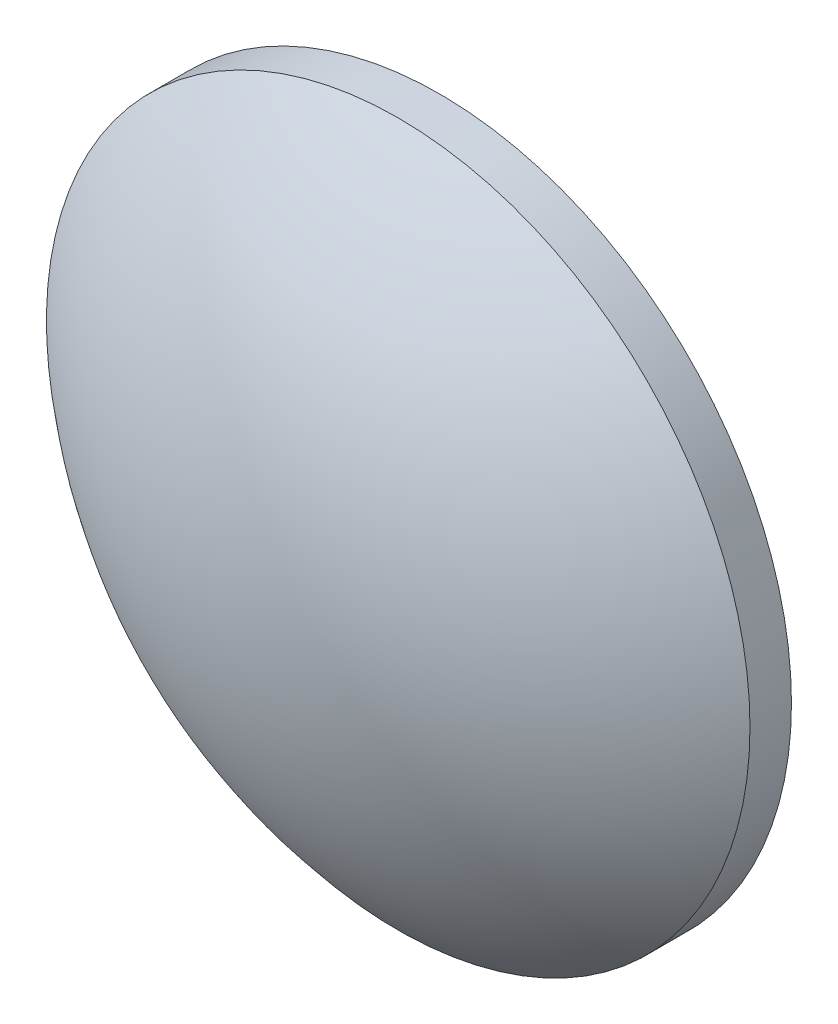
ISO-10303-21;
HEADER;
FILE_DESCRIPTION(('STEP AP214'),'2;1');
FILE_NAME('part.step','',(''),(''),'','','');
FILE_SCHEMA(('AUTOMOTIVE_DESIGN { 1 0 10303 214 1 1 1 1 }'));
ENDSEC;
DATA;
#1=APPLICATION_CONTEXT('core data for automotive mechanical design processes');
#2=APPLICATION_PROTOCOL_DEFINITION('international standard','automotive_design',2000,#1);
#3=PRODUCT_CONTEXT('',#1,'mechanical');
#4=PRODUCT('Part','Part','',(#3));
#5=PRODUCT_RELATED_PRODUCT_CATEGORY('part','',(#4));
#6=PRODUCT_DEFINITION_FORMATION('','',#4);
#7=PRODUCT_DEFINITION_CONTEXT('part definition',#1,'design');
#8=PRODUCT_DEFINITION('design','',#6,#7);
#9=PRODUCT_DEFINITION_SHAPE('','',#8);
#10=(LENGTH_UNIT() NAMED_UNIT(*) SI_UNIT(.MILLI.,.METRE.));
#11=(NAMED_UNIT(*) PLANE_ANGLE_UNIT() SI_UNIT($,.RADIAN.));
#12=(NAMED_UNIT(*) SI_UNIT($,.STERADIAN.) SOLID_ANGLE_UNIT());
#13=UNCERTAINTY_MEASURE_WITH_UNIT(LENGTH_MEASURE(1.E-05),#10,'distance_accuracy_value','');
#14=(GEOMETRIC_REPRESENTATION_CONTEXT(3) GLOBAL_UNCERTAINTY_ASSIGNED_CONTEXT((#13)) GLOBAL_UNIT_ASSIGNED_CONTEXT((#10,
#11,#12)) REPRESENTATION_CONTEXT('',''));
#15=CARTESIAN_POINT('',(0.,0.,0.));
#16=DIRECTION('',(0.,0.,1.));
#17=DIRECTION('',(1.,0.,0.));
#18=AXIS2_PLACEMENT_3D('',#15,#16,#17);
#19=CARTESIAN_POINT('',(0.,0.,-32.37));
#20=DIRECTION('',(0.,0.,1.));
#21=DIRECTION('',(0.,1.,0.));
#22=AXIS2_PLACEMENT_3D('',#19,#20,#21);
#23=SPHERICAL_SURFACE('',#22,38.63);
#24=CARTESIAN_POINT('',(0.,0.,-3.26472728181369));
#25=DIRECTION('',(0.,0.,1.));
#26=DIRECTION('',(1.,0.,0.));
#27=AXIS2_PLACEMENT_3D('',#24,#25,#26);
#28=CIRCLE('',#27,25.4);
#29=CARTESIAN_POINT('',(25.4,0.,-3.26472728181369));
#30=VERTEX_POINT('',#29);
#31=EDGE_CURVE('E8',#30,#30,#28,.T.);
#32=ORIENTED_EDGE('',*,*,#31,.T.);
#33=EDGE_LOOP('',(#32));
#34=FACE_BOUND('',#33,.T.);
#35=ADVANCED_FACE('F12',(#34),#23,.T.);
#36=CARTESIAN_POINT('',(0.,0.,4.30813204540037));
#37=DIRECTION('',(0.,0.,1.));
#38=DIRECTION('',(1.,0.,0.));
#39=AXIS2_PLACEMENT_3D('',#36,#37,#38);
#40=CYLINDRICAL_SURFACE('',#39,25.4);
#41=ORIENTED_EDGE('',*,*,#31,.F.);
#42=EDGE_LOOP('',(#41));
#43=FACE_BOUND('',#42,.T.);
#44=CARTESIAN_POINT('',(0.,0.,-6.26));
#45=DIRECTION('',(0.,0.,1.));
#46=DIRECTION('',(1.,0.,0.));
#47=AXIS2_PLACEMENT_3D('',#44,#45,#46);
#48=CIRCLE('',#47,25.4);
#49=CARTESIAN_POINT('',(25.4,0.,-6.26));
#50=VERTEX_POINT('',#49);
#51=EDGE_CURVE('E18',#50,#50,#48,.T.);
#52=ORIENTED_EDGE('',*,*,#51,.T.);
#53=EDGE_LOOP('',(#52));
#54=FACE_BOUND('',#53,.T.);
#55=ADVANCED_FACE('F24',(#43,#54),#40,.T.);
#56=CARTESIAN_POINT('',(0.,0.,-6.26));
#57=DIRECTION('',(0.,0.,1.));
#58=DIRECTION('',(1.,0.,0.));
#59=AXIS2_PLACEMENT_3D('',#56,#57,#58);
#60=PLANE('',#59);
#61=ORIENTED_EDGE('',*,*,#51,.F.);
#62=EDGE_LOOP('',(#61));
#63=FACE_BOUND('',#62,.T.);
#64=ADVANCED_FACE('F26',(#63),#60,.F.);
#65=CLOSED_SHELL('',(#35,#55,#64));
#66=MANIFOLD_SOLID_BREP('B1',#65);
#67=ADVANCED_BREP_SHAPE_REPRESENTATION('',(#18,#66),#14);
#68=SHAPE_DEFINITION_REPRESENTATION(#9,#67);
ENDSEC;
END-ISO-10303-21;
